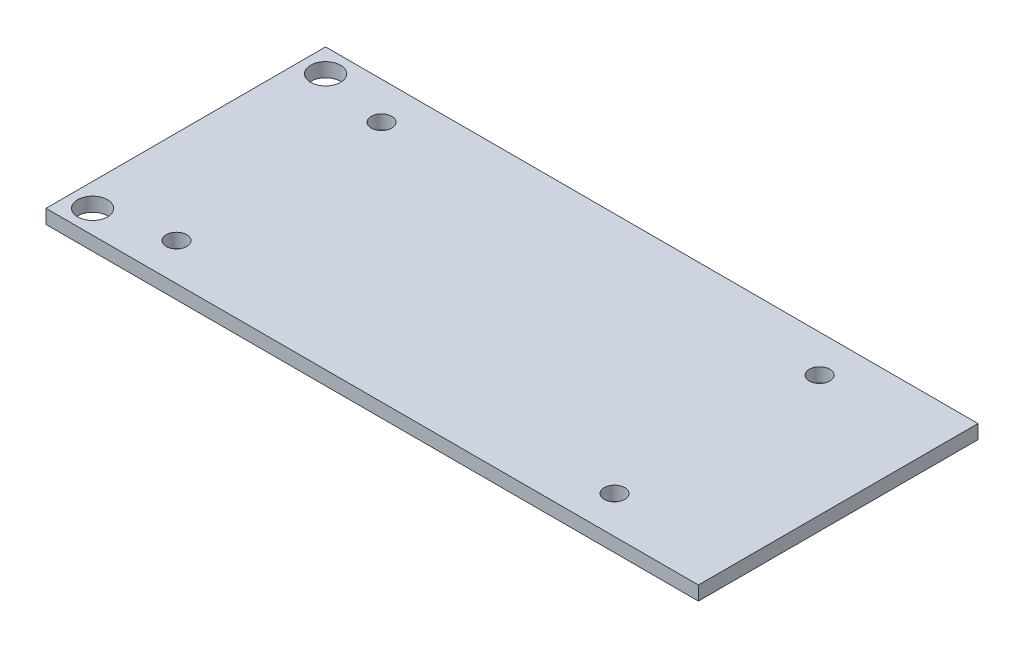
ISO-10303-21;
HEADER;
FILE_DESCRIPTION(('STEP AP214'),'2;1');
FILE_NAME('part.step','',(''),(''),'','','');
FILE_SCHEMA(('AUTOMOTIVE_DESIGN { 1 0 10303 214 1 1 1 1 }'));
ENDSEC;
DATA;
#1=APPLICATION_CONTEXT('core data for automotive mechanical design processes');
#2=APPLICATION_PROTOCOL_DEFINITION('international standard','automotive_design',2000,#1);
#3=PRODUCT_CONTEXT('',#1,'mechanical');
#4=PRODUCT('Part','Part','',(#3));
#5=PRODUCT_RELATED_PRODUCT_CATEGORY('part','',(#4));
#6=PRODUCT_DEFINITION_FORMATION('','',#4);
#7=PRODUCT_DEFINITION_CONTEXT('part definition',#1,'design');
#8=PRODUCT_DEFINITION('design','',#6,#7);
#9=PRODUCT_DEFINITION_SHAPE('','',#8);
#10=(LENGTH_UNIT() NAMED_UNIT(*) SI_UNIT(.MILLI.,.METRE.));
#11=(NAMED_UNIT(*) PLANE_ANGLE_UNIT() SI_UNIT($,.RADIAN.));
#12=(NAMED_UNIT(*) SI_UNIT($,.STERADIAN.) SOLID_ANGLE_UNIT());
#13=UNCERTAINTY_MEASURE_WITH_UNIT(LENGTH_MEASURE(1.E-05),#10,'distance_accuracy_value','');
#14=(GEOMETRIC_REPRESENTATION_CONTEXT(3) GLOBAL_UNCERTAINTY_ASSIGNED_CONTEXT((#13)) GLOBAL_UNIT_ASSIGNED_CONTEXT((#10,
#11,#12)) REPRESENTATION_CONTEXT('',''));
#15=CARTESIAN_POINT('',(0.,0.,0.));
#16=DIRECTION('',(0.,0.,1.));
#17=DIRECTION('',(1.,0.,0.));
#18=AXIS2_PLACEMENT_3D('',#15,#16,#17);
#19=CARTESIAN_POINT('',(0.,1.5,0.));
#20=DIRECTION('',(0.,-1.,0.));
#21=DIRECTION('',(0.,0.,-1.));
#22=AXIS2_PLACEMENT_3D('',#19,#20,#21);
#23=PLANE('',#22);
#24=DIRECTION('',(0.,0.,1.));
#25=VECTOR('',#24,1.);
#26=CARTESIAN_POINT('',(0.,1.5,0.));
#27=LINE('',#26,#25);
#28=CARTESIAN_POINT('',(0.,1.5,-30.));
#29=VERTEX_POINT('',#28);
#30=CARTESIAN_POINT('',(0.,1.5,0.));
#31=VERTEX_POINT('',#30);
#32=EDGE_CURVE('E92',#29,#31,#27,.T.);
#33=ORIENTED_EDGE('',*,*,#32,.T.);
#34=DIRECTION('',(1.,0.,0.));
#35=VECTOR('',#34,1.);
#36=CARTESIAN_POINT('',(0.,1.5,0.));
#37=LINE('',#36,#35);
#38=CARTESIAN_POINT('',(70.,1.5,0.));
#39=VERTEX_POINT('',#38);
#40=EDGE_CURVE('E87',#31,#39,#37,.T.);
#41=ORIENTED_EDGE('',*,*,#40,.T.);
#42=DIRECTION('',(0.,0.,-1.));
#43=VECTOR('',#42,1.);
#44=CARTESIAN_POINT('',(70.,1.5,0.));
#45=LINE('',#44,#43);
#46=CARTESIAN_POINT('',(70.,1.5,-30.));
#47=VERTEX_POINT('',#46);
#48=EDGE_CURVE('E90',#39,#47,#45,.T.);
#49=ORIENTED_EDGE('',*,*,#48,.T.);
#50=DIRECTION('',(-1.,0.,0.));
#51=VECTOR('',#50,1.);
#52=CARTESIAN_POINT('',(0.,1.5,-30.));
#53=LINE('',#52,#51);
#54=EDGE_CURVE('E57',#47,#29,#53,.T.);
#55=ORIENTED_EDGE('',*,*,#54,.T.);
#56=EDGE_LOOP('',(#33,#41,#49,#55));
#57=FACE_BOUND('',#56,.T.);
#58=CARTESIAN_POINT('',(10.,1.5,-4.));
#59=DIRECTION('',(0.,1.,0.));
#60=DIRECTION('',(0.,0.,1.));
#61=AXIS2_PLACEMENT_3D('',#58,#59,#60);
#62=CIRCLE('',#61,1.1);
#63=CARTESIAN_POINT('',(10.,1.5,-2.9));
#64=VERTEX_POINT('',#63);
#65=EDGE_CURVE('E112',#64,#64,#62,.T.);
#66=ORIENTED_EDGE('',*,*,#65,.F.);
#67=EDGE_LOOP('',(#66));
#68=FACE_BOUND('',#67,.T.);
#69=CARTESIAN_POINT('',(2.5,1.5,-2.5));
#70=DIRECTION('',(0.,1.,0.));
#71=DIRECTION('',(0.,0.,1.));
#72=AXIS2_PLACEMENT_3D('',#69,#70,#71);
#73=CIRCLE('',#72,1.6);
#74=CARTESIAN_POINT('',(2.5,1.5,-0.9));
#75=VERTEX_POINT('',#74);
#76=EDGE_CURVE('E134',#75,#75,#73,.T.);
#77=ORIENTED_EDGE('',*,*,#76,.F.);
#78=EDGE_LOOP('',(#77));
#79=FACE_BOUND('',#78,.T.);
#80=CARTESIAN_POINT('',(57.,1.5,-4.));
#81=DIRECTION('',(0.,1.,0.));
#82=DIRECTION('',(0.,0.,1.));
#83=AXIS2_PLACEMENT_3D('',#80,#81,#82);
#84=CIRCLE('',#83,1.1);
#85=CARTESIAN_POINT('',(57.,1.5,-2.9));
#86=VERTEX_POINT('',#85);
#87=EDGE_CURVE('E142',#86,#86,#84,.T.);
#88=ORIENTED_EDGE('',*,*,#87,.F.);
#89=EDGE_LOOP('',(#88));
#90=FACE_BOUND('',#89,.T.);
#91=CARTESIAN_POINT('',(56.9999999999999,1.5,-26.));
#92=DIRECTION('',(0.,1.,0.));
#93=DIRECTION('',(0.,0.,1.));
#94=AXIS2_PLACEMENT_3D('',#91,#92,#93);
#95=CIRCLE('',#94,1.1);
#96=CARTESIAN_POINT('',(56.9999999999999,1.5,-24.9));
#97=VERTEX_POINT('',#96);
#98=EDGE_CURVE('E150',#97,#97,#95,.T.);
#99=ORIENTED_EDGE('',*,*,#98,.F.);
#100=EDGE_LOOP('',(#99));
#101=FACE_BOUND('',#100,.T.);
#102=CARTESIAN_POINT('',(9.99999999999992,1.5,-26.));
#103=DIRECTION('',(0.,1.,0.));
#104=DIRECTION('',(0.,0.,1.));
#105=AXIS2_PLACEMENT_3D('',#102,#103,#104);
#106=CIRCLE('',#105,1.1);
#107=CARTESIAN_POINT('',(9.99999999999992,1.5,-24.9));
#108=VERTEX_POINT('',#107);
#109=EDGE_CURVE('E158',#108,#108,#106,.T.);
#110=ORIENTED_EDGE('',*,*,#109,.F.);
#111=EDGE_LOOP('',(#110));
#112=FACE_BOUND('',#111,.T.);
#113=CARTESIAN_POINT('',(2.5,1.5,-27.5));
#114=DIRECTION('',(0.,1.,0.));
#115=DIRECTION('',(0.,0.,-1.));
#116=AXIS2_PLACEMENT_3D('',#113,#114,#115);
#117=CIRCLE('',#116,1.6);
#118=CARTESIAN_POINT('',(2.5,1.5,-29.1));
#119=VERTEX_POINT('',#118);
#120=EDGE_CURVE('E166',#119,#119,#117,.T.);
#121=ORIENTED_EDGE('',*,*,#120,.F.);
#122=EDGE_LOOP('',(#121));
#123=FACE_BOUND('',#122,.T.);
#124=ADVANCED_FACE('F39',(#57,#68,#79,#90,#101,#112,#123),#23,.F.);
#125=CARTESIAN_POINT('',(0.,0.,0.));
#126=DIRECTION('',(0.,-1.,0.));
#127=DIRECTION('',(0.,0.,-1.));
#128=AXIS2_PLACEMENT_3D('',#125,#126,#127);
#129=PLANE('',#128);
#130=CARTESIAN_POINT('',(9.99999999999992,0.,-26.));
#131=DIRECTION('',(0.,1.,0.));
#132=DIRECTION('',(0.,0.,1.));
#133=AXIS2_PLACEMENT_3D('',#130,#131,#132);
#134=CIRCLE('',#133,1.1);
#135=CARTESIAN_POINT('',(9.99999999999992,0.,-24.9));
#136=VERTEX_POINT('',#135);
#137=EDGE_CURVE('E162',#136,#136,#134,.T.);
#138=ORIENTED_EDGE('',*,*,#137,.T.);
#139=EDGE_LOOP('',(#138));
#140=FACE_BOUND('',#139,.T.);
#141=CARTESIAN_POINT('',(57.,0.,-4.));
#142=DIRECTION('',(0.,1.,0.));
#143=DIRECTION('',(0.,0.,1.));
#144=AXIS2_PLACEMENT_3D('',#141,#142,#143);
#145=CIRCLE('',#144,1.1);
#146=CARTESIAN_POINT('',(57.,0.,-2.9));
#147=VERTEX_POINT('',#146);
#148=EDGE_CURVE('E146',#147,#147,#145,.T.);
#149=ORIENTED_EDGE('',*,*,#148,.T.);
#150=EDGE_LOOP('',(#149));
#151=FACE_BOUND('',#150,.T.);
#152=CARTESIAN_POINT('',(10.,0.,-4.));
#153=DIRECTION('',(0.,1.,0.));
#154=DIRECTION('',(0.,0.,1.));
#155=AXIS2_PLACEMENT_3D('',#152,#153,#154);
#156=CIRCLE('',#155,1.1);
#157=CARTESIAN_POINT('',(10.,0.,-2.9));
#158=VERTEX_POINT('',#157);
#159=EDGE_CURVE('E130',#158,#158,#156,.T.);
#160=ORIENTED_EDGE('',*,*,#159,.T.);
#161=EDGE_LOOP('',(#160));
#162=FACE_BOUND('',#161,.T.);
#163=DIRECTION('',(0.,0.,1.));
#164=VECTOR('',#163,1.);
#165=CARTESIAN_POINT('',(0.,0.,0.));
#166=LINE('',#165,#164);
#167=CARTESIAN_POINT('',(0.,0.,-30.));
#168=VERTEX_POINT('',#167);
#169=CARTESIAN_POINT('',(0.,0.,0.));
#170=VERTEX_POINT('',#169);
#171=EDGE_CURVE('E108',#168,#170,#166,.T.);
#172=ORIENTED_EDGE('',*,*,#171,.F.);
#173=DIRECTION('',(-1.,0.,0.));
#174=VECTOR('',#173,1.);
#175=CARTESIAN_POINT('',(0.,0.,-30.));
#176=LINE('',#175,#174);
#177=CARTESIAN_POINT('',(70.,0.,-30.));
#178=VERTEX_POINT('',#177);
#179=EDGE_CURVE('E80',#178,#168,#176,.T.);
#180=ORIENTED_EDGE('',*,*,#179,.F.);
#181=DIRECTION('',(0.,0.,-1.));
#182=VECTOR('',#181,1.);
#183=CARTESIAN_POINT('',(70.,0.,0.));
#184=LINE('',#183,#182);
#185=CARTESIAN_POINT('',(70.,0.,0.));
#186=VERTEX_POINT('',#185);
#187=EDGE_CURVE('E74',#186,#178,#184,.T.);
#188=ORIENTED_EDGE('',*,*,#187,.F.);
#189=DIRECTION('',(1.,0.,0.));
#190=VECTOR('',#189,1.);
#191=CARTESIAN_POINT('',(0.,0.,0.));
#192=LINE('',#191,#190);
#193=EDGE_CURVE('E97',#170,#186,#192,.T.);
#194=ORIENTED_EDGE('',*,*,#193,.F.);
#195=EDGE_LOOP('',(#172,#180,#188,#194));
#196=FACE_BOUND('',#195,.T.);
#197=CARTESIAN_POINT('',(2.5,0.,-2.5));
#198=DIRECTION('',(0.,1.,0.));
#199=DIRECTION('',(0.,0.,1.));
#200=AXIS2_PLACEMENT_3D('',#197,#198,#199);
#201=CIRCLE('',#200,1.6);
#202=CARTESIAN_POINT('',(2.5,0.,-0.9));
#203=VERTEX_POINT('',#202);
#204=EDGE_CURVE('E138',#203,#203,#201,.T.);
#205=ORIENTED_EDGE('',*,*,#204,.T.);
#206=EDGE_LOOP('',(#205));
#207=FACE_BOUND('',#206,.T.);
#208=CARTESIAN_POINT('',(56.9999999999999,0.,-26.));
#209=DIRECTION('',(0.,1.,0.));
#210=DIRECTION('',(0.,0.,1.));
#211=AXIS2_PLACEMENT_3D('',#208,#209,#210);
#212=CIRCLE('',#211,1.1);
#213=CARTESIAN_POINT('',(56.9999999999999,0.,-24.9));
#214=VERTEX_POINT('',#213);
#215=EDGE_CURVE('E154',#214,#214,#212,.T.);
#216=ORIENTED_EDGE('',*,*,#215,.T.);
#217=EDGE_LOOP('',(#216));
#218=FACE_BOUND('',#217,.T.);
#219=CARTESIAN_POINT('',(2.5,0.,-27.5));
#220=DIRECTION('',(0.,1.,0.));
#221=DIRECTION('',(0.,0.,-1.));
#222=AXIS2_PLACEMENT_3D('',#219,#220,#221);
#223=CIRCLE('',#222,1.6);
#224=CARTESIAN_POINT('',(2.5,0.,-29.1));
#225=VERTEX_POINT('',#224);
#226=EDGE_CURVE('E170',#225,#225,#223,.T.);
#227=ORIENTED_EDGE('',*,*,#226,.T.);
#228=EDGE_LOOP('',(#227));
#229=FACE_BOUND('',#228,.T.);
#230=ADVANCED_FACE('F125',(#140,#151,#162,#196,#207,#218,#229),#129,.T.);
#231=CARTESIAN_POINT('',(0.,1.5,0.));
#232=DIRECTION('',(1.,0.,0.));
#233=DIRECTION('',(0.,0.,-1.));
#234=AXIS2_PLACEMENT_3D('',#231,#232,#233);
#235=PLANE('',#234);
#236=ORIENTED_EDGE('',*,*,#171,.T.);
#237=DIRECTION('',(0.,-1.,0.));
#238=VECTOR('',#237,1.);
#239=CARTESIAN_POINT('',(0.,1.5,0.));
#240=LINE('',#239,#238);
#241=EDGE_CURVE('E11',#31,#170,#240,.T.);
#242=ORIENTED_EDGE('',*,*,#241,.F.);
#243=ORIENTED_EDGE('',*,*,#32,.F.);
#244=DIRECTION('',(0.,-1.,0.));
#245=VECTOR('',#244,1.);
#246=CARTESIAN_POINT('',(0.,1.5,-30.));
#247=LINE('',#246,#245);
#248=EDGE_CURVE('E104',#29,#168,#247,.T.);
#249=ORIENTED_EDGE('',*,*,#248,.T.);
#250=EDGE_LOOP('',(#236,#242,#243,#249));
#251=FACE_BOUND('',#250,.T.);
#252=ADVANCED_FACE('F41',(#251),#235,.F.);
#253=CARTESIAN_POINT('',(0.,1.5,0.));
#254=DIRECTION('',(0.,0.,-1.));
#255=DIRECTION('',(-1.,0.,0.));
#256=AXIS2_PLACEMENT_3D('',#253,#254,#255);
#257=PLANE('',#256);
#258=ORIENTED_EDGE('',*,*,#193,.T.);
#259=DIRECTION('',(0.,-1.,0.));
#260=VECTOR('',#259,1.);
#261=CARTESIAN_POINT('',(70.,1.5,0.));
#262=LINE('',#261,#260);
#263=EDGE_CURVE('E49',#39,#186,#262,.T.);
#264=ORIENTED_EDGE('',*,*,#263,.F.);
#265=ORIENTED_EDGE('',*,*,#40,.F.);
#266=ORIENTED_EDGE('',*,*,#241,.T.);
#267=EDGE_LOOP('',(#258,#264,#265,#266));
#268=FACE_BOUND('',#267,.T.);
#269=ADVANCED_FACE('F96',(#268),#257,.F.);
#270=CARTESIAN_POINT('',(70.,1.5,0.));
#271=DIRECTION('',(-1.,0.,0.));
#272=DIRECTION('',(0.,0.,1.));
#273=AXIS2_PLACEMENT_3D('',#270,#271,#272);
#274=PLANE('',#273);
#275=ORIENTED_EDGE('',*,*,#187,.T.);
#276=DIRECTION('',(0.,-1.,0.));
#277=VECTOR('',#276,1.);
#278=CARTESIAN_POINT('',(70.,1.5,-30.));
#279=LINE('',#278,#277);
#280=EDGE_CURVE('E99',#47,#178,#279,.T.);
#281=ORIENTED_EDGE('',*,*,#280,.F.);
#282=ORIENTED_EDGE('',*,*,#48,.F.);
#283=ORIENTED_EDGE('',*,*,#263,.T.);
#284=EDGE_LOOP('',(#275,#281,#282,#283));
#285=FACE_BOUND('',#284,.T.);
#286=ADVANCED_FACE('F100',(#285),#274,.F.);
#287=CARTESIAN_POINT('',(0.,1.5,-30.));
#288=DIRECTION('',(0.,0.,1.));
#289=DIRECTION('',(1.,0.,0.));
#290=AXIS2_PLACEMENT_3D('',#287,#288,#289);
#291=PLANE('',#290);
#292=ORIENTED_EDGE('',*,*,#179,.T.);
#293=ORIENTED_EDGE('',*,*,#248,.F.);
#294=ORIENTED_EDGE('',*,*,#54,.F.);
#295=ORIENTED_EDGE('',*,*,#280,.T.);
#296=EDGE_LOOP('',(#292,#293,#294,#295));
#297=FACE_BOUND('',#296,.T.);
#298=ADVANCED_FACE('F122',(#297),#291,.F.);
#299=CARTESIAN_POINT('',(10.,1.5,-4.));
#300=DIRECTION('',(0.,-1.,0.));
#301=DIRECTION('',(0.,0.,-1.));
#302=AXIS2_PLACEMENT_3D('',#299,#300,#301);
#303=CYLINDRICAL_SURFACE('',#302,1.1);
#304=ORIENTED_EDGE('',*,*,#65,.T.);
#305=EDGE_LOOP('',(#304));
#306=FACE_BOUND('',#305,.T.);
#307=ORIENTED_EDGE('',*,*,#159,.F.);
#308=EDGE_LOOP('',(#307));
#309=FACE_BOUND('',#308,.T.);
#310=ADVANCED_FACE('F189',(#306,#309),#303,.F.);
#311=CARTESIAN_POINT('',(2.5,1.5,-2.5));
#312=DIRECTION('',(0.,-1.,0.));
#313=DIRECTION('',(0.,0.,-1.));
#314=AXIS2_PLACEMENT_3D('',#311,#312,#313);
#315=CYLINDRICAL_SURFACE('',#314,1.6);
#316=ORIENTED_EDGE('',*,*,#76,.T.);
#317=EDGE_LOOP('',(#316));
#318=FACE_BOUND('',#317,.T.);
#319=ORIENTED_EDGE('',*,*,#204,.F.);
#320=EDGE_LOOP('',(#319));
#321=FACE_BOUND('',#320,.T.);
#322=ADVANCED_FACE('F235',(#318,#321),#315,.F.);
#323=CARTESIAN_POINT('',(57.,1.5,-4.));
#324=DIRECTION('',(0.,-1.,0.));
#325=DIRECTION('',(0.,0.,-1.));
#326=AXIS2_PLACEMENT_3D('',#323,#324,#325);
#327=CYLINDRICAL_SURFACE('',#326,1.1);
#328=ORIENTED_EDGE('',*,*,#87,.T.);
#329=EDGE_LOOP('',(#328));
#330=FACE_BOUND('',#329,.T.);
#331=ORIENTED_EDGE('',*,*,#148,.F.);
#332=EDGE_LOOP('',(#331));
#333=FACE_BOUND('',#332,.T.);
#334=ADVANCED_FACE('F243',(#330,#333),#327,.F.);
#335=CARTESIAN_POINT('',(56.9999999999999,1.5,-26.));
#336=DIRECTION('',(0.,-1.,0.));
#337=DIRECTION('',(0.,0.,-1.));
#338=AXIS2_PLACEMENT_3D('',#335,#336,#337);
#339=CYLINDRICAL_SURFACE('',#338,1.1);
#340=ORIENTED_EDGE('',*,*,#98,.T.);
#341=EDGE_LOOP('',(#340));
#342=FACE_BOUND('',#341,.T.);
#343=ORIENTED_EDGE('',*,*,#215,.F.);
#344=EDGE_LOOP('',(#343));
#345=FACE_BOUND('',#344,.T.);
#346=ADVANCED_FACE('F251',(#342,#345),#339,.F.);
#347=CARTESIAN_POINT('',(9.99999999999992,1.5,-26.));
#348=DIRECTION('',(0.,-1.,0.));
#349=DIRECTION('',(0.,0.,-1.));
#350=AXIS2_PLACEMENT_3D('',#347,#348,#349);
#351=CYLINDRICAL_SURFACE('',#350,1.1);
#352=ORIENTED_EDGE('',*,*,#109,.T.);
#353=EDGE_LOOP('',(#352));
#354=FACE_BOUND('',#353,.T.);
#355=ORIENTED_EDGE('',*,*,#137,.F.);
#356=EDGE_LOOP('',(#355));
#357=FACE_BOUND('',#356,.T.);
#358=ADVANCED_FACE('F260',(#354,#357),#351,.F.);
#359=CARTESIAN_POINT('',(2.5,1.5,-27.5));
#360=DIRECTION('',(0.,-1.,0.));
#361=DIRECTION('',(0.,0.,-1.));
#362=AXIS2_PLACEMENT_3D('',#359,#360,#361);
#363=CYLINDRICAL_SURFACE('',#362,1.6);
#364=ORIENTED_EDGE('',*,*,#120,.T.);
#365=EDGE_LOOP('',(#364));
#366=FACE_BOUND('',#365,.T.);
#367=ORIENTED_EDGE('',*,*,#226,.F.);
#368=EDGE_LOOP('',(#367));
#369=FACE_BOUND('',#368,.T.);
#370=ADVANCED_FACE('F178',(#366,#369),#363,.F.);
#371=CLOSED_SHELL('',(#124,#230,#252,#269,#286,#298,#310,#322,#334,#346,#358,#370));
#372=MANIFOLD_SOLID_BREP('B2',#371);
#373=ADVANCED_BREP_SHAPE_REPRESENTATION('',(#18,#372),#14);
#374=SHAPE_DEFINITION_REPRESENTATION(#9,#373);
ENDSEC;
END-ISO-10303-21;
